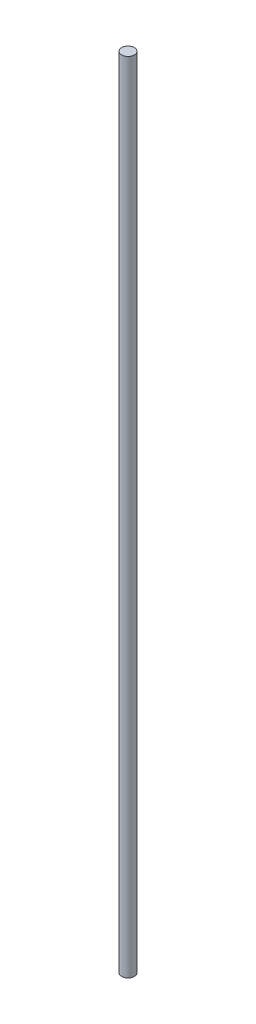
ISO-10303-21;
HEADER;
FILE_DESCRIPTION(('STEP AP214'),'2;1');
FILE_NAME('part.step','',(''),(''),'','','');
FILE_SCHEMA(('AUTOMOTIVE_DESIGN { 1 0 10303 214 1 1 1 1 }'));
ENDSEC;
DATA;
#1=APPLICATION_CONTEXT('core data for automotive mechanical design processes');
#2=APPLICATION_PROTOCOL_DEFINITION('international standard','automotive_design',2000,#1);
#3=PRODUCT_CONTEXT('',#1,'mechanical');
#4=PRODUCT('Part','Part','',(#3));
#5=PRODUCT_RELATED_PRODUCT_CATEGORY('part','',(#4));
#6=PRODUCT_DEFINITION_FORMATION('','',#4);
#7=PRODUCT_DEFINITION_CONTEXT('part definition',#1,'design');
#8=PRODUCT_DEFINITION('design','',#6,#7);
#9=PRODUCT_DEFINITION_SHAPE('','',#8);
#10=(LENGTH_UNIT() NAMED_UNIT(*) SI_UNIT(.MILLI.,.METRE.));
#11=(NAMED_UNIT(*) PLANE_ANGLE_UNIT() SI_UNIT($,.RADIAN.));
#12=(NAMED_UNIT(*) SI_UNIT($,.STERADIAN.) SOLID_ANGLE_UNIT());
#13=UNCERTAINTY_MEASURE_WITH_UNIT(LENGTH_MEASURE(1.E-05),#10,'distance_accuracy_value','');
#14=(GEOMETRIC_REPRESENTATION_CONTEXT(3) GLOBAL_UNCERTAINTY_ASSIGNED_CONTEXT((#13)) GLOBAL_UNIT_ASSIGNED_CONTEXT((#10,
#11,#12)) REPRESENTATION_CONTEXT('',''));
#15=CARTESIAN_POINT('',(0.,0.,0.));
#16=DIRECTION('',(0.,0.,1.));
#17=DIRECTION('',(1.,0.,0.));
#18=AXIS2_PLACEMENT_3D('',#15,#16,#17);
#19=CARTESIAN_POINT('',(0.,62.5,0.));
#20=DIRECTION('',(0.,-1.,0.));
#21=DIRECTION('',(0.,0.,-1.));
#22=AXIS2_PLACEMENT_3D('',#19,#20,#21);
#23=CYLINDRICAL_SURFACE('',#22,0.5);
#24=CARTESIAN_POINT('',(0.,62.5,0.));
#25=DIRECTION('',(0.,1.,0.));
#26=DIRECTION('',(0.,0.,1.));
#27=AXIS2_PLACEMENT_3D('',#24,#25,#26);
#28=CIRCLE('',#27,0.5);
#29=CARTESIAN_POINT('',(0.,62.5,0.5));
#30=VERTEX_POINT('',#29);
#31=EDGE_CURVE('E10',#30,#30,#28,.T.);
#32=ORIENTED_EDGE('',*,*,#31,.F.);
#33=EDGE_LOOP('',(#32));
#34=FACE_BOUND('',#33,.T.);
#35=CARTESIAN_POINT('',(0.,0.,0.));
#36=DIRECTION('',(0.,1.,0.));
#37=DIRECTION('',(0.,0.,1.));
#38=AXIS2_PLACEMENT_3D('',#35,#36,#37);
#39=CIRCLE('',#38,0.5);
#40=CARTESIAN_POINT('',(0.,0.,0.5));
#41=VERTEX_POINT('',#40);
#42=EDGE_CURVE('E48',#41,#41,#39,.T.);
#43=ORIENTED_EDGE('',*,*,#42,.T.);
#44=EDGE_LOOP('',(#43));
#45=FACE_BOUND('',#44,.T.);
#46=ADVANCED_FACE('F45',(#34,#45),#23,.T.);
#47=CARTESIAN_POINT('',(0.,62.5,0.));
#48=DIRECTION('',(0.,1.,0.));
#49=DIRECTION('',(0.,0.,1.));
#50=AXIS2_PLACEMENT_3D('',#47,#48,#49);
#51=PLANE('',#50);
#52=ORIENTED_EDGE('',*,*,#31,.T.);
#53=EDGE_LOOP('',(#52));
#54=FACE_BOUND('',#53,.T.);
#55=ADVANCED_FACE('F62',(#54),#51,.T.);
#56=CARTESIAN_POINT('',(0.,0.,0.));
#57=DIRECTION('',(0.,1.,0.));
#58=DIRECTION('',(0.,0.,1.));
#59=AXIS2_PLACEMENT_3D('',#56,#57,#58);
#60=PLANE('',#59);
#61=ORIENTED_EDGE('',*,*,#42,.F.);
#62=EDGE_LOOP('',(#61));
#63=FACE_BOUND('',#62,.T.);
#64=ADVANCED_FACE('F60',(#63),#60,.F.);
#65=CLOSED_SHELL('',(#46,#55,#64));
#66=MANIFOLD_SOLID_BREP('B2',#65);
#67=ADVANCED_BREP_SHAPE_REPRESENTATION('',(#18,#66),#14);
#68=SHAPE_DEFINITION_REPRESENTATION(#9,#67);
ENDSEC;
END-ISO-10303-21;
